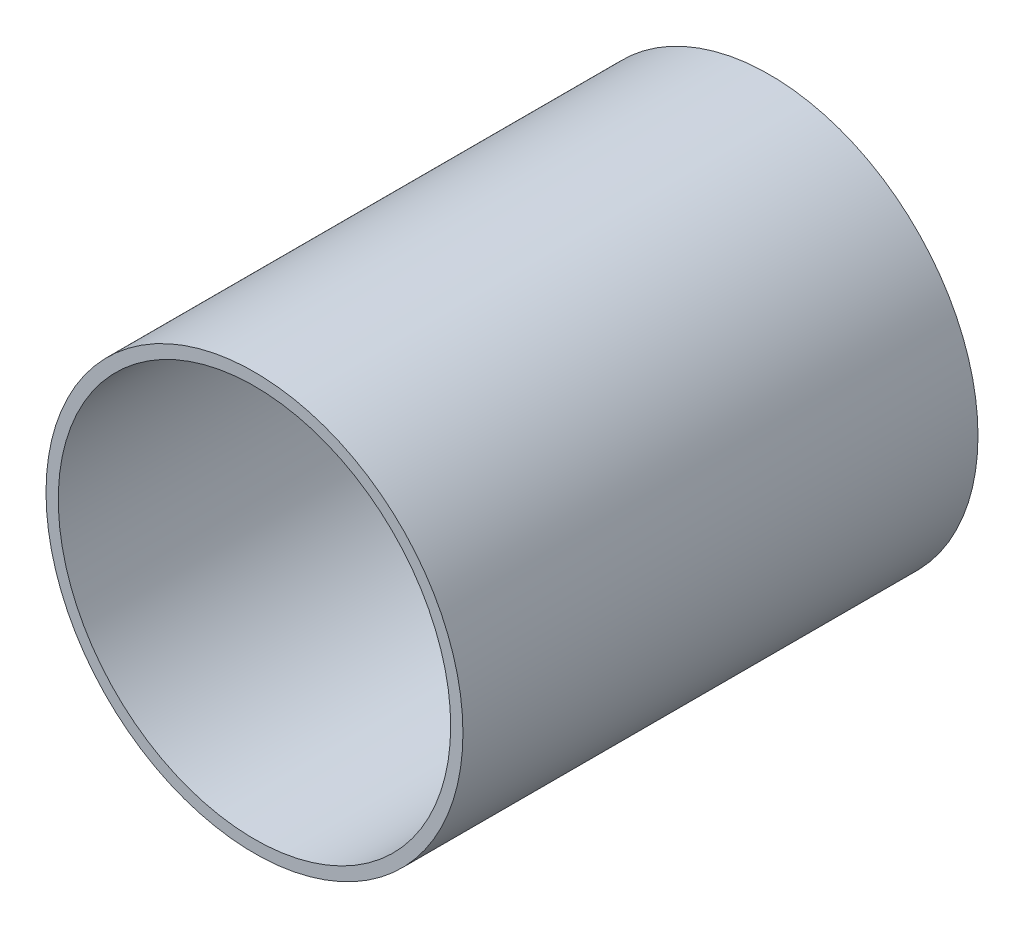
ISO-10303-21;
HEADER;
FILE_DESCRIPTION(('STEP AP214'),'2;1');
FILE_NAME('part.step','',(''),(''),'','','');
FILE_SCHEMA(('AUTOMOTIVE_DESIGN { 1 0 10303 214 1 1 1 1 }'));
ENDSEC;
DATA;
#1=APPLICATION_CONTEXT('core data for automotive mechanical design processes');
#2=APPLICATION_PROTOCOL_DEFINITION('international standard','automotive_design',2000,#1);
#3=PRODUCT_CONTEXT('',#1,'mechanical');
#4=PRODUCT('Part','Part','',(#3));
#5=PRODUCT_RELATED_PRODUCT_CATEGORY('part','',(#4));
#6=PRODUCT_DEFINITION_FORMATION('','',#4);
#7=PRODUCT_DEFINITION_CONTEXT('part definition',#1,'design');
#8=PRODUCT_DEFINITION('design','',#6,#7);
#9=PRODUCT_DEFINITION_SHAPE('','',#8);
#10=(LENGTH_UNIT() NAMED_UNIT(*) SI_UNIT(.MILLI.,.METRE.));
#11=(NAMED_UNIT(*) PLANE_ANGLE_UNIT() SI_UNIT($,.RADIAN.));
#12=(NAMED_UNIT(*) SI_UNIT($,.STERADIAN.) SOLID_ANGLE_UNIT());
#13=UNCERTAINTY_MEASURE_WITH_UNIT(LENGTH_MEASURE(1.E-05),#10,'distance_accuracy_value','');
#14=(GEOMETRIC_REPRESENTATION_CONTEXT(3) GLOBAL_UNCERTAINTY_ASSIGNED_CONTEXT((#13)) GLOBAL_UNIT_ASSIGNED_CONTEXT((#10,
#11,#12)) REPRESENTATION_CONTEXT('',''));
#15=CARTESIAN_POINT('',(0.,0.,0.));
#16=DIRECTION('',(0.,0.,1.));
#17=DIRECTION('',(1.,0.,0.));
#18=AXIS2_PLACEMENT_3D('',#15,#16,#17);
#19=CARTESIAN_POINT('',(0.,0.,6.35));
#20=DIRECTION('',(0.,0.,1.));
#21=DIRECTION('',(1.,0.,0.));
#22=AXIS2_PLACEMENT_3D('',#19,#20,#21);
#23=PLANE('',#22);
#24=CARTESIAN_POINT('',(0.,0.,6.35));
#25=DIRECTION('',(0.,0.,1.));
#26=DIRECTION('',(1.,0.,0.));
#27=AXIS2_PLACEMENT_3D('',#24,#25,#26);
#28=CIRCLE('',#27,6.4389);
#29=CARTESIAN_POINT('',(6.4389,0.,6.35));
#30=VERTEX_POINT('',#29);
#31=EDGE_CURVE('E67',#30,#30,#28,.T.);
#32=ORIENTED_EDGE('',*,*,#31,.F.);
#33=EDGE_LOOP('',(#32));
#34=FACE_BOUND('',#33,.T.);
#35=CARTESIAN_POINT('',(0.,0.,6.34999999999999));
#36=DIRECTION('',(0.,0.,1.));
#37=DIRECTION('',(1.,0.,0.));
#38=AXIS2_PLACEMENT_3D('',#35,#36,#37);
#39=CIRCLE('',#38,50.8);
#40=CARTESIAN_POINT('',(50.8,0.,6.34999999999999));
#41=VERTEX_POINT('',#40);
#42=EDGE_CURVE('E10',#41,#41,#39,.F.);
#43=ORIENTED_EDGE('',*,*,#42,.F.);
#44=EDGE_LOOP('',(#43));
#45=FACE_BOUND('',#44,.T.);
#46=ADVANCED_FACE('F43',(#34,#45),#23,.T.);
#47=CARTESIAN_POINT('',(0.,0.,6.35));
#48=DIRECTION('',(0.,0.,-1.));
#49=DIRECTION('',(-1.,0.,0.));
#50=AXIS2_PLACEMENT_3D('',#47,#48,#49);
#51=CYLINDRICAL_SURFACE('',#50,53.975);
#52=CARTESIAN_POINT('',(0.,0.,0.));
#53=DIRECTION('',(0.,0.,1.));
#54=DIRECTION('',(1.,0.,0.));
#55=AXIS2_PLACEMENT_3D('',#52,#53,#54);
#56=CIRCLE('',#55,53.975);
#57=CARTESIAN_POINT('',(53.975,0.,0.));
#58=VERTEX_POINT('',#57);
#59=EDGE_CURVE('E51',#58,#58,#56,.T.);
#60=ORIENTED_EDGE('',*,*,#59,.T.);
#61=EDGE_LOOP('',(#60));
#62=FACE_BOUND('',#61,.T.);
#63=CARTESIAN_POINT('',(0.,0.,133.35));
#64=DIRECTION('',(0.,0.,1.));
#65=DIRECTION('',(1.,0.,0.));
#66=AXIS2_PLACEMENT_3D('',#63,#64,#65);
#67=CIRCLE('',#66,53.975);
#68=CARTESIAN_POINT('',(53.975,0.,133.35));
#69=VERTEX_POINT('',#68);
#70=EDGE_CURVE('E71',#69,#69,#67,.T.);
#71=ORIENTED_EDGE('',*,*,#70,.F.);
#72=EDGE_LOOP('',(#71));
#73=FACE_BOUND('',#72,.T.);
#74=ADVANCED_FACE('F45',(#62,#73),#51,.T.);
#75=CARTESIAN_POINT('',(0.,0.,0.));
#76=DIRECTION('',(0.,0.,1.));
#77=DIRECTION('',(1.,0.,0.));
#78=AXIS2_PLACEMENT_3D('',#75,#76,#77);
#79=PLANE('',#78);
#80=CARTESIAN_POINT('',(0.,0.,0.));
#81=DIRECTION('',(0.,0.,1.));
#82=DIRECTION('',(1.,0.,0.));
#83=AXIS2_PLACEMENT_3D('',#80,#81,#82);
#84=CIRCLE('',#83,3.37819999999998);
#85=CARTESIAN_POINT('',(3.37819999999998,0.,0.));
#86=VERTEX_POINT('',#85);
#87=EDGE_CURVE('E56',#86,#86,#84,.T.);
#88=ORIENTED_EDGE('',*,*,#87,.T.);
#89=EDGE_LOOP('',(#88));
#90=FACE_BOUND('',#89,.T.);
#91=ORIENTED_EDGE('',*,*,#59,.F.);
#92=EDGE_LOOP('',(#91));
#93=FACE_BOUND('',#92,.T.);
#94=ADVANCED_FACE('F101',(#90,#93),#79,.F.);
#95=CARTESIAN_POINT('',(0.,0.,6.35));
#96=DIRECTION('',(0.,0.,1.));
#97=DIRECTION('',(1.,0.,0.));
#98=AXIS2_PLACEMENT_3D('',#95,#96,#97);
#99=CYLINDRICAL_SURFACE('',#98,3.37819999999998);
#100=ORIENTED_EDGE('',*,*,#87,.F.);
#101=EDGE_LOOP('',(#100));
#102=FACE_BOUND('',#101,.T.);
#103=CARTESIAN_POINT('',(0.,0.,3.78176775885567));
#104=DIRECTION('',(0.,0.,1.));
#105=DIRECTION('',(1.,0.,0.));
#106=AXIS2_PLACEMENT_3D('',#103,#104,#105);
#107=CIRCLE('',#106,3.37819999999998);
#108=CARTESIAN_POINT('',(3.37819999999998,0.,3.78176775885567));
#109=VERTEX_POINT('',#108);
#110=EDGE_CURVE('E61',#109,#109,#107,.T.);
#111=ORIENTED_EDGE('',*,*,#110,.T.);
#112=EDGE_LOOP('',(#111));
#113=FACE_BOUND('',#112,.T.);
#114=ADVANCED_FACE('F93',(#102,#113),#99,.F.);
#115=CARTESIAN_POINT('',(0.,0.,6.35));
#116=DIRECTION('',(0.,0.,1.));
#117=DIRECTION('',(1.,0.,0.));
#118=AXIS2_PLACEMENT_3D('',#115,#116,#117);
#119=CONICAL_SURFACE('',#118,6.4389,0.872664625997162);
#120=ORIENTED_EDGE('',*,*,#110,.F.);
#121=EDGE_LOOP('',(#120));
#122=FACE_BOUND('',#121,.T.);
#123=ORIENTED_EDGE('',*,*,#31,.T.);
#124=EDGE_LOOP('',(#123));
#125=FACE_BOUND('',#124,.T.);
#126=ADVANCED_FACE('F84',(#122,#125),#119,.F.);
#127=CARTESIAN_POINT('',(0.,0.,133.35));
#128=DIRECTION('',(0.,0.,1.));
#129=DIRECTION('',(1.,0.,0.));
#130=AXIS2_PLACEMENT_3D('',#127,#128,#129);
#131=PLANE('',#130);
#132=ORIENTED_EDGE('',*,*,#70,.T.);
#133=EDGE_LOOP('',(#132));
#134=FACE_BOUND('',#133,.T.);
#135=CARTESIAN_POINT('',(0.,0.,133.35));
#136=DIRECTION('',(0.,0.,1.));
#137=DIRECTION('',(1.,0.,0.));
#138=AXIS2_PLACEMENT_3D('',#135,#136,#137);
#139=CIRCLE('',#138,50.8);
#140=CARTESIAN_POINT('',(50.8,0.,133.35));
#141=VERTEX_POINT('',#140);
#142=EDGE_CURVE('E75',#141,#141,#139,.T.);
#143=ORIENTED_EDGE('',*,*,#142,.F.);
#144=EDGE_LOOP('',(#143));
#145=FACE_BOUND('',#144,.T.);
#146=ADVANCED_FACE('F82',(#134,#145),#131,.T.);
#147=CARTESIAN_POINT('',(0.,0.,133.35));
#148=DIRECTION('',(0.,0.,-1.));
#149=DIRECTION('',(-1.,0.,0.));
#150=AXIS2_PLACEMENT_3D('',#147,#148,#149);
#151=CYLINDRICAL_SURFACE('',#150,50.8);
#152=ORIENTED_EDGE('',*,*,#142,.T.);
#153=EDGE_LOOP('',(#152));
#154=FACE_BOUND('',#153,.T.);
#155=ORIENTED_EDGE('',*,*,#42,.T.);
#156=EDGE_LOOP('',(#155));
#157=FACE_BOUND('',#156,.T.);
#158=ADVANCED_FACE('F80',(#154,#157),#151,.F.);
#159=CLOSED_SHELL('',(#46,#74,#94,#114,#126,#146,#158));
#160=MANIFOLD_SOLID_BREP('B2',#159);
#161=ADVANCED_BREP_SHAPE_REPRESENTATION('',(#18,#160),#14);
#162=SHAPE_DEFINITION_REPRESENTATION(#9,#161);
ENDSEC;
END-ISO-10303-21;
